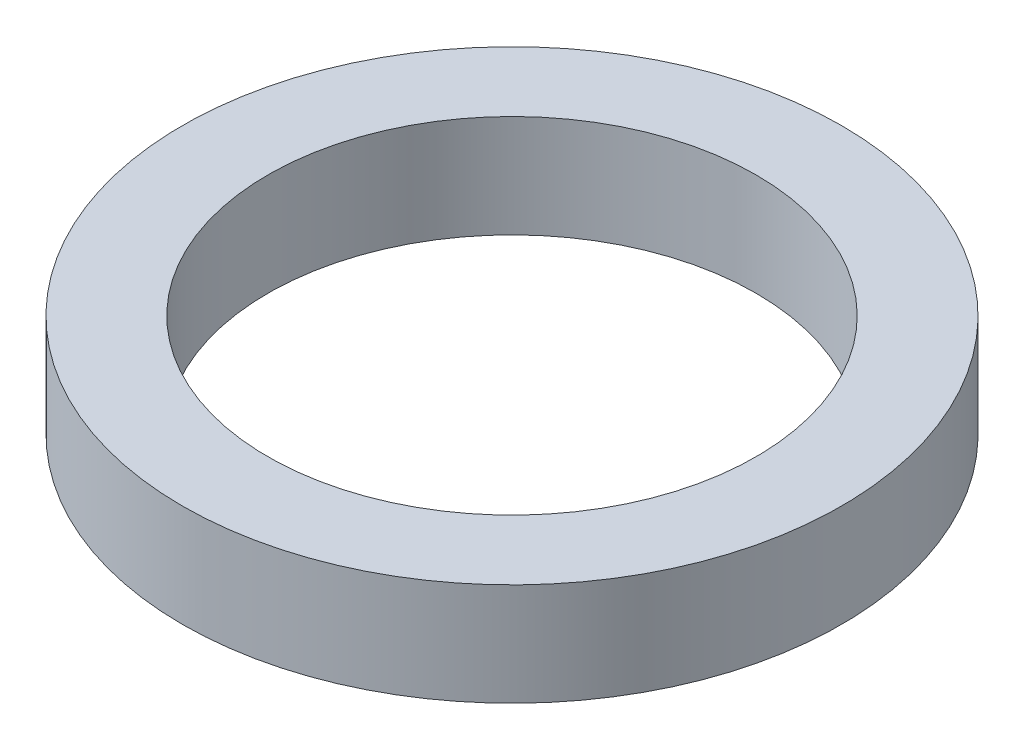
ISO-10303-21;
HEADER;
FILE_DESCRIPTION(('STEP AP214'),'2;1');
FILE_NAME('part.step','',(''),(''),'','','');
FILE_SCHEMA(('AUTOMOTIVE_DESIGN { 1 0 10303 214 1 1 1 1 }'));
ENDSEC;
DATA;
#1=APPLICATION_CONTEXT('core data for automotive mechanical design processes');
#2=APPLICATION_PROTOCOL_DEFINITION('international standard','automotive_design',2000,#1);
#3=PRODUCT_CONTEXT('',#1,'mechanical');
#4=PRODUCT('Part','Part','',(#3));
#5=PRODUCT_RELATED_PRODUCT_CATEGORY('part','',(#4));
#6=PRODUCT_DEFINITION_FORMATION('','',#4);
#7=PRODUCT_DEFINITION_CONTEXT('part definition',#1,'design');
#8=PRODUCT_DEFINITION('design','',#6,#7);
#9=PRODUCT_DEFINITION_SHAPE('','',#8);
#10=(LENGTH_UNIT() NAMED_UNIT(*) SI_UNIT(.MILLI.,.METRE.));
#11=(NAMED_UNIT(*) PLANE_ANGLE_UNIT() SI_UNIT($,.RADIAN.));
#12=(NAMED_UNIT(*) SI_UNIT($,.STERADIAN.) SOLID_ANGLE_UNIT());
#13=UNCERTAINTY_MEASURE_WITH_UNIT(LENGTH_MEASURE(1.E-05),#10,'distance_accuracy_value','');
#14=(GEOMETRIC_REPRESENTATION_CONTEXT(3) GLOBAL_UNCERTAINTY_ASSIGNED_CONTEXT((#13)) GLOBAL_UNIT_ASSIGNED_CONTEXT((#10,
#11,#12)) REPRESENTATION_CONTEXT('',''));
#15=CARTESIAN_POINT('',(0.,0.,0.));
#16=DIRECTION('',(0.,0.,1.));
#17=DIRECTION('',(1.,0.,0.));
#18=AXIS2_PLACEMENT_3D('',#15,#16,#17);
#19=CARTESIAN_POINT('',(0.,21.,0.));
#20=DIRECTION('',(0.,-1.,0.));
#21=DIRECTION('',(0.,0.,-1.));
#22=AXIS2_PLACEMENT_3D('',#19,#20,#21);
#23=CYLINDRICAL_SURFACE('',#22,67.5);
#24=CARTESIAN_POINT('',(0.,21.,0.));
#25=DIRECTION('',(0.,1.,0.));
#26=DIRECTION('',(0.,0.,1.));
#27=AXIS2_PLACEMENT_3D('',#24,#25,#26);
#28=CIRCLE('',#27,67.5);
#29=CARTESIAN_POINT('',(0.,21.,-67.5));
#30=VERTEX_POINT('',#29);
#31=EDGE_CURVE('E10',#30,#30,#28,.T.);
#32=CARTESIAN_POINT('',(0.,0.,0.));
#33=DIRECTION('',(0.,1.,0.));
#34=DIRECTION('',(0.,0.,1.));
#35=AXIS2_PLACEMENT_3D('',#32,#33,#34);
#36=CIRCLE('',#35,67.5);
#37=CARTESIAN_POINT('',(0.,0.,-67.5));
#38=VERTEX_POINT('',#37);
#39=EDGE_CURVE('E37',#38,#38,#36,.T.);
#40=CARTESIAN_POINT('',(0.,21.,-67.5));
#41=CARTESIAN_POINT('',(0.,20.78125,-67.5));
#42=CARTESIAN_POINT('',(0.,20.5625,-67.5));
#43=CARTESIAN_POINT('',(0.,20.125,-67.5));
#44=CARTESIAN_POINT('',(0.,19.90625,-67.5));
#45=CARTESIAN_POINT('',(0.,19.46875,-67.5));
#46=CARTESIAN_POINT('',(0.,19.25,-67.5));
#47=CARTESIAN_POINT('',(0.,18.8125,-67.5));
#48=CARTESIAN_POINT('',(0.,18.59375,-67.5));
#49=CARTESIAN_POINT('',(0.,18.15625,-67.5));
#50=CARTESIAN_POINT('',(0.,17.9375,-67.5));
#51=CARTESIAN_POINT('',(0.,17.5,-67.5));
#52=CARTESIAN_POINT('',(0.,17.28125,-67.5));
#53=CARTESIAN_POINT('',(0.,16.84375,-67.5));
#54=CARTESIAN_POINT('',(0.,16.625,-67.5));
#55=CARTESIAN_POINT('',(0.,16.1875,-67.5));
#56=CARTESIAN_POINT('',(0.,15.96875,-67.5));
#57=CARTESIAN_POINT('',(0.,15.53125,-67.5));
#58=CARTESIAN_POINT('',(0.,15.3125,-67.5));
#59=CARTESIAN_POINT('',(0.,14.875,-67.5));
#60=CARTESIAN_POINT('',(0.,14.65625,-67.5));
#61=CARTESIAN_POINT('',(0.,14.21875,-67.5));
#62=CARTESIAN_POINT('',(0.,14.,-67.5));
#63=CARTESIAN_POINT('',(0.,13.5625,-67.5));
#64=CARTESIAN_POINT('',(0.,13.34375,-67.5));
#65=CARTESIAN_POINT('',(0.,12.90625,-67.5));
#66=CARTESIAN_POINT('',(0.,12.6875,-67.5));
#67=CARTESIAN_POINT('',(0.,12.25,-67.5));
#68=CARTESIAN_POINT('',(0.,12.03125,-67.5));
#69=CARTESIAN_POINT('',(0.,11.59375,-67.5));
#70=CARTESIAN_POINT('',(0.,11.375,-67.5));
#71=CARTESIAN_POINT('',(0.,10.9375,-67.5));
#72=CARTESIAN_POINT('',(0.,10.71875,-67.5));
#73=CARTESIAN_POINT('',(0.,10.28125,-67.5));
#74=CARTESIAN_POINT('',(0.,10.0625,-67.5));
#75=CARTESIAN_POINT('',(0.,9.625,-67.5));
#76=CARTESIAN_POINT('',(0.,9.40625,-67.5));
#77=CARTESIAN_POINT('',(0.,8.96875,-67.5));
#78=CARTESIAN_POINT('',(0.,8.75,-67.5));
#79=CARTESIAN_POINT('',(0.,8.3125,-67.5));
#80=CARTESIAN_POINT('',(0.,8.09375,-67.5));
#81=CARTESIAN_POINT('',(0.,7.65625,-67.5));
#82=CARTESIAN_POINT('',(0.,7.4375,-67.5));
#83=CARTESIAN_POINT('',(0.,7.,-67.5));
#84=CARTESIAN_POINT('',(0.,6.78125,-67.5));
#85=CARTESIAN_POINT('',(0.,6.34375,-67.5));
#86=CARTESIAN_POINT('',(0.,6.125,-67.5));
#87=CARTESIAN_POINT('',(0.,5.6875,-67.5));
#88=CARTESIAN_POINT('',(0.,5.46875,-67.5));
#89=CARTESIAN_POINT('',(0.,5.03125,-67.5));
#90=CARTESIAN_POINT('',(0.,4.8125,-67.5));
#91=CARTESIAN_POINT('',(0.,4.375,-67.5));
#92=CARTESIAN_POINT('',(0.,4.15625,-67.5));
#93=CARTESIAN_POINT('',(0.,3.71875,-67.5));
#94=CARTESIAN_POINT('',(0.,3.5,-67.5));
#95=CARTESIAN_POINT('',(0.,3.0625,-67.5));
#96=CARTESIAN_POINT('',(0.,2.84375,-67.5));
#97=CARTESIAN_POINT('',(0.,2.40625,-67.5));
#98=CARTESIAN_POINT('',(0.,2.1875,-67.5));
#99=CARTESIAN_POINT('',(0.,1.75,-67.5));
#100=CARTESIAN_POINT('',(0.,1.53125,-67.5));
#101=CARTESIAN_POINT('',(0.,1.09375,-67.5));
#102=CARTESIAN_POINT('',(0.,0.875000000000001,-67.5));
#103=CARTESIAN_POINT('',(0.,0.4375,-67.5));
#104=CARTESIAN_POINT('',(0.,0.21875,-67.5));
#105=CARTESIAN_POINT('',(0.,0.,-67.5));
#106=B_SPLINE_CURVE_WITH_KNOTS('',3,(#40,#41,#42,#43,#44,#45,#46,#47,#48,#49,#50,#51,#52,#53,
#54,#55,#56,#57,#58,#59,#60,#61,#62,#63,#64,#65,#66,#67,#68,#69,#70,#71,#72,#73,#74,#75,#76,#77,
#78,#79,#80,#81,#82,#83,#84,#85,#86,#87,#88,#89,#90,#91,#92,#93,#94,#95,#96,#97,#98,#99,#100,
#101,#102,#103,#104,#105),.UNSPECIFIED.,.F.,.F.,(4,2,2,2,2,2,2,2,2,2,2,2,2,2,2,2,2,2,2,2,2,2,2,
2,2,2,2,2,2,2,2,2,4),(0.,0.656250000000001,1.3125,1.96875,2.625,3.28125,3.9375,4.59375,5.25,
5.90625,6.5625,7.21875,7.875,8.53125,9.1875,9.84375,10.5,11.15625,11.8125,12.46875,13.125,
13.78125,14.4375,15.09375,15.75,16.40625,17.0625,17.71875,18.375,19.03125,19.6875,20.34375,21.),.UNSPECIFIED.);
#107=EDGE_CURVE('BSEAM40',#30,#38,#106,.T.);
#108=ORIENTED_EDGE('',*,*,#31,.F.);
#109=ORIENTED_EDGE('',*,*,#39,.T.);
#110=ORIENTED_EDGE('',*,*,#107,.T.);
#111=ORIENTED_EDGE('',*,*,#107,.F.);
#112=EDGE_LOOP('',(#108,#110,#109,#111));
#113=FACE_BOUND('',#112,.T.);
#114=ADVANCED_FACE('F40',(#113),#23,.T.);
#115=CARTESIAN_POINT('',(0.,21.,0.));
#116=DIRECTION('',(0.,1.,0.));
#117=DIRECTION('',(0.,0.,1.));
#118=AXIS2_PLACEMENT_3D('',#115,#116,#117);
#119=PLANE('',#118);
#120=CARTESIAN_POINT('',(0.,21.,0.));
#121=DIRECTION('',(0.,1.,0.));
#122=DIRECTION('',(0.,0.,1.));
#123=AXIS2_PLACEMENT_3D('',#120,#121,#122);
#124=CIRCLE('',#123,50.);
#125=CARTESIAN_POINT('',(0.,21.,-50.));
#126=VERTEX_POINT('',#125);
#127=EDGE_CURVE('E50',#126,#126,#124,.T.);
#128=ORIENTED_EDGE('',*,*,#127,.F.);
#129=EDGE_LOOP('',(#128));
#130=FACE_BOUND('',#129,.T.);
#131=ORIENTED_EDGE('',*,*,#31,.T.);
#132=EDGE_LOOP('',(#131));
#133=FACE_BOUND('',#132,.T.);
#134=ADVANCED_FACE('F59',(#130,#133),#119,.T.);
#135=CARTESIAN_POINT('',(0.,0.,0.));
#136=DIRECTION('',(0.,1.,0.));
#137=DIRECTION('',(0.,0.,1.));
#138=AXIS2_PLACEMENT_3D('',#135,#136,#137);
#139=PLANE('',#138);
#140=CARTESIAN_POINT('',(0.,0.,0.));
#141=DIRECTION('',(0.,1.,0.));
#142=DIRECTION('',(0.,0.,1.));
#143=AXIS2_PLACEMENT_3D('',#140,#141,#142);
#144=CIRCLE('',#143,50.);
#145=CARTESIAN_POINT('',(0.,0.,-50.));
#146=VERTEX_POINT('',#145);
#147=EDGE_CURVE('E47',#146,#146,#144,.T.);
#148=ORIENTED_EDGE('',*,*,#147,.T.);
#149=EDGE_LOOP('',(#148));
#150=FACE_BOUND('',#149,.T.);
#151=ORIENTED_EDGE('',*,*,#39,.F.);
#152=EDGE_LOOP('',(#151));
#153=FACE_BOUND('',#152,.T.);
#154=ADVANCED_FACE('F58',(#150,#153),#139,.F.);
#155=CARTESIAN_POINT('',(0.,21.,0.));
#156=DIRECTION('',(0.,-1.,0.));
#157=DIRECTION('',(0.,0.,-1.));
#158=AXIS2_PLACEMENT_3D('',#155,#156,#157);
#159=CYLINDRICAL_SURFACE('',#158,50.);
#160=CARTESIAN_POINT('',(0.,21.,-50.));
#161=CARTESIAN_POINT('',(0.,20.78125,-50.));
#162=CARTESIAN_POINT('',(0.,20.5625,-50.));
#163=CARTESIAN_POINT('',(0.,20.125,-50.));
#164=CARTESIAN_POINT('',(0.,19.90625,-50.));
#165=CARTESIAN_POINT('',(0.,19.46875,-50.));
#166=CARTESIAN_POINT('',(0.,19.25,-50.));
#167=CARTESIAN_POINT('',(0.,18.8125,-50.));
#168=CARTESIAN_POINT('',(0.,18.59375,-50.));
#169=CARTESIAN_POINT('',(0.,18.15625,-50.));
#170=CARTESIAN_POINT('',(0.,17.9375,-50.));
#171=CARTESIAN_POINT('',(0.,17.5,-50.));
#172=CARTESIAN_POINT('',(0.,17.28125,-50.));
#173=CARTESIAN_POINT('',(0.,16.84375,-50.));
#174=CARTESIAN_POINT('',(0.,16.625,-50.));
#175=CARTESIAN_POINT('',(0.,16.1875,-50.));
#176=CARTESIAN_POINT('',(0.,15.96875,-50.));
#177=CARTESIAN_POINT('',(0.,15.53125,-50.));
#178=CARTESIAN_POINT('',(0.,15.3125,-50.));
#179=CARTESIAN_POINT('',(0.,14.875,-50.));
#180=CARTESIAN_POINT('',(0.,14.65625,-50.));
#181=CARTESIAN_POINT('',(0.,14.21875,-50.));
#182=CARTESIAN_POINT('',(0.,14.,-50.));
#183=CARTESIAN_POINT('',(0.,13.5625,-50.));
#184=CARTESIAN_POINT('',(0.,13.34375,-50.));
#185=CARTESIAN_POINT('',(0.,12.90625,-50.));
#186=CARTESIAN_POINT('',(0.,12.6875,-50.));
#187=CARTESIAN_POINT('',(0.,12.25,-50.));
#188=CARTESIAN_POINT('',(0.,12.03125,-50.));
#189=CARTESIAN_POINT('',(0.,11.59375,-50.));
#190=CARTESIAN_POINT('',(0.,11.375,-50.));
#191=CARTESIAN_POINT('',(0.,10.9375,-50.));
#192=CARTESIAN_POINT('',(0.,10.71875,-50.));
#193=CARTESIAN_POINT('',(0.,10.28125,-50.));
#194=CARTESIAN_POINT('',(0.,10.0625,-50.));
#195=CARTESIAN_POINT('',(0.,9.625,-50.));
#196=CARTESIAN_POINT('',(0.,9.40625,-50.));
#197=CARTESIAN_POINT('',(0.,8.96875,-50.));
#198=CARTESIAN_POINT('',(0.,8.75,-50.));
#199=CARTESIAN_POINT('',(0.,8.3125,-50.));
#200=CARTESIAN_POINT('',(0.,8.09375,-50.));
#201=CARTESIAN_POINT('',(0.,7.65625,-50.));
#202=CARTESIAN_POINT('',(0.,7.4375,-50.));
#203=CARTESIAN_POINT('',(0.,7.,-50.));
#204=CARTESIAN_POINT('',(0.,6.78125,-50.));
#205=CARTESIAN_POINT('',(0.,6.34375,-50.));
#206=CARTESIAN_POINT('',(0.,6.125,-50.));
#207=CARTESIAN_POINT('',(0.,5.6875,-50.));
#208=CARTESIAN_POINT('',(0.,5.46875,-50.));
#209=CARTESIAN_POINT('',(0.,5.03125,-50.));
#210=CARTESIAN_POINT('',(0.,4.8125,-50.));
#211=CARTESIAN_POINT('',(0.,4.375,-50.));
#212=CARTESIAN_POINT('',(0.,4.15625,-50.));
#213=CARTESIAN_POINT('',(0.,3.71875,-50.));
#214=CARTESIAN_POINT('',(0.,3.5,-50.));
#215=CARTESIAN_POINT('',(0.,3.0625,-50.));
#216=CARTESIAN_POINT('',(0.,2.84375,-50.));
#217=CARTESIAN_POINT('',(0.,2.40625,-50.));
#218=CARTESIAN_POINT('',(0.,2.1875,-50.));
#219=CARTESIAN_POINT('',(0.,1.75,-50.));
#220=CARTESIAN_POINT('',(0.,1.53125,-50.));
#221=CARTESIAN_POINT('',(0.,1.09375,-50.));
#222=CARTESIAN_POINT('',(0.,0.875000000000001,-50.));
#223=CARTESIAN_POINT('',(0.,0.4375,-50.));
#224=CARTESIAN_POINT('',(0.,0.21875,-50.));
#225=CARTESIAN_POINT('',(0.,0.,-50.));
#226=B_SPLINE_CURVE_WITH_KNOTS('',3,(#160,#161,#162,#163,#164,#165,#166,#167,#168,#169,#170,
#171,#172,#173,#174,#175,#176,#177,#178,#179,#180,#181,#182,#183,#184,#185,#186,#187,#188,#189,
#190,#191,#192,#193,#194,#195,#196,#197,#198,#199,#200,#201,#202,#203,#204,#205,#206,#207,#208,
#209,#210,#211,#212,#213,#214,#215,#216,#217,#218,#219,#220,#221,#222,#223,#224,#225),
.UNSPECIFIED.,.F.,.F.,(4,2,2,2,2,2,2,2,2,2,2,2,2,2,2,2,2,2,2,2,2,2,2,2,2,2,2,2,2,2,2,2,4),(0.,
0.656249999999997,1.3125,1.96875,2.625,3.28125,3.9375,4.59375,5.25,5.90625,6.5625,7.21875,7.875,
8.53125,9.1875,9.84375,10.5,11.15625,11.8125,12.46875,13.125,13.78125,14.4375,15.09375,15.75,
16.40625,17.0625,17.71875,18.375,19.03125,19.6875,20.34375,21.),.UNSPECIFIED.);
#227=EDGE_CURVE('BSEAM54',#126,#146,#226,.T.);
#228=ORIENTED_EDGE('',*,*,#127,.T.);
#229=ORIENTED_EDGE('',*,*,#147,.F.);
#230=ORIENTED_EDGE('',*,*,#227,.T.);
#231=ORIENTED_EDGE('',*,*,#227,.F.);
#232=EDGE_LOOP('',(#228,#230,#229,#231));
#233=FACE_BOUND('',#232,.T.);
#234=ADVANCED_FACE('F54',(#233),#159,.F.);
#235=CLOSED_SHELL('',(#114,#134,#154,#234));
#236=MANIFOLD_SOLID_BREP('B2',#235);
#237=ADVANCED_BREP_SHAPE_REPRESENTATION('',(#18,#236),#14);
#238=SHAPE_DEFINITION_REPRESENTATION(#9,#237);
ENDSEC;
END-ISO-10303-21;
